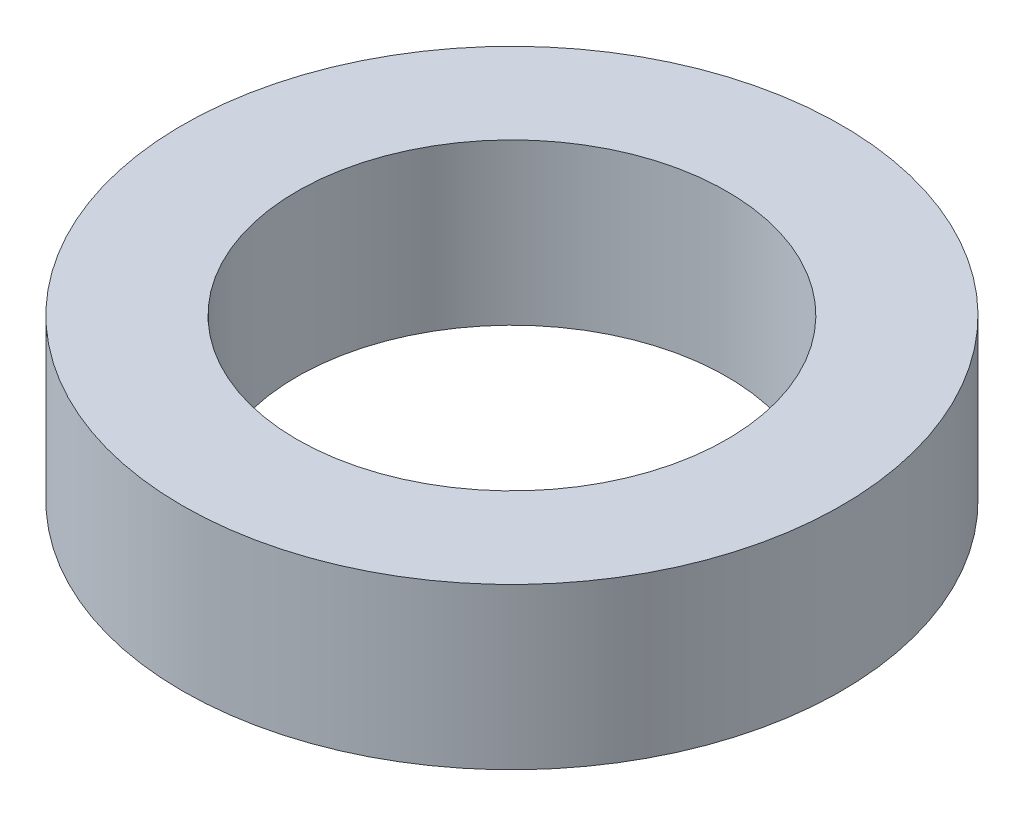
ISO-10303-21;
HEADER;
FILE_DESCRIPTION(('STEP AP214'),'2;1');
FILE_NAME('part.step','',(''),(''),'','','');
FILE_SCHEMA(('AUTOMOTIVE_DESIGN { 1 0 10303 214 1 1 1 1 }'));
ENDSEC;
DATA;
#1=APPLICATION_CONTEXT('core data for automotive mechanical design processes');
#2=APPLICATION_PROTOCOL_DEFINITION('international standard','automotive_design',2000,#1);
#3=PRODUCT_CONTEXT('',#1,'mechanical');
#4=PRODUCT('Part','Part','',(#3));
#5=PRODUCT_RELATED_PRODUCT_CATEGORY('part','',(#4));
#6=PRODUCT_DEFINITION_FORMATION('','',#4);
#7=PRODUCT_DEFINITION_CONTEXT('part definition',#1,'design');
#8=PRODUCT_DEFINITION('design','',#6,#7);
#9=PRODUCT_DEFINITION_SHAPE('','',#8);
#10=(LENGTH_UNIT() NAMED_UNIT(*) SI_UNIT(.MILLI.,.METRE.));
#11=(NAMED_UNIT(*) PLANE_ANGLE_UNIT() SI_UNIT($,.RADIAN.));
#12=(NAMED_UNIT(*) SI_UNIT($,.STERADIAN.) SOLID_ANGLE_UNIT());
#13=UNCERTAINTY_MEASURE_WITH_UNIT(LENGTH_MEASURE(1.E-05),#10,'distance_accuracy_value','');
#14=(GEOMETRIC_REPRESENTATION_CONTEXT(3) GLOBAL_UNCERTAINTY_ASSIGNED_CONTEXT((#13)) GLOBAL_UNIT_ASSIGNED_CONTEXT((#10,
#11,#12)) REPRESENTATION_CONTEXT('',''));
#15=CARTESIAN_POINT('',(0.,0.,0.));
#16=DIRECTION('',(0.,0.,1.));
#17=DIRECTION('',(1.,0.,0.));
#18=AXIS2_PLACEMENT_3D('',#15,#16,#17);
#19=CARTESIAN_POINT('',(0.,28.,0.));
#20=DIRECTION('',(0.,-1.,0.));
#21=DIRECTION('',(0.,0.,-1.));
#22=AXIS2_PLACEMENT_3D('',#19,#20,#21);
#23=CYLINDRICAL_SURFACE('',#22,57.5);
#24=CARTESIAN_POINT('',(0.,28.,0.));
#25=DIRECTION('',(0.,1.,0.));
#26=DIRECTION('',(0.,0.,1.));
#27=AXIS2_PLACEMENT_3D('',#24,#25,#26);
#28=CIRCLE('',#27,57.5);
#29=CARTESIAN_POINT('',(0.,28.,57.5));
#30=VERTEX_POINT('',#29);
#31=EDGE_CURVE('E10',#30,#30,#28,.T.);
#32=ORIENTED_EDGE('',*,*,#31,.F.);
#33=EDGE_LOOP('',(#32));
#34=FACE_BOUND('',#33,.T.);
#35=CARTESIAN_POINT('',(0.,0.,0.));
#36=DIRECTION('',(0.,1.,0.));
#37=DIRECTION('',(0.,0.,1.));
#38=AXIS2_PLACEMENT_3D('',#35,#36,#37);
#39=CIRCLE('',#38,57.5);
#40=CARTESIAN_POINT('',(0.,0.,57.5));
#41=VERTEX_POINT('',#40);
#42=EDGE_CURVE('E37',#41,#41,#39,.T.);
#43=ORIENTED_EDGE('',*,*,#42,.T.);
#44=EDGE_LOOP('',(#43));
#45=FACE_BOUND('',#44,.T.);
#46=ADVANCED_FACE('F40',(#34,#45),#23,.T.);
#47=CARTESIAN_POINT('',(0.,28.,0.));
#48=DIRECTION('',(0.,1.,0.));
#49=DIRECTION('',(0.,0.,1.));
#50=AXIS2_PLACEMENT_3D('',#47,#48,#49);
#51=PLANE('',#50);
#52=CARTESIAN_POINT('',(0.,28.,0.));
#53=DIRECTION('',(0.,1.,0.));
#54=DIRECTION('',(0.,0.,1.));
#55=AXIS2_PLACEMENT_3D('',#52,#53,#54);
#56=CIRCLE('',#55,37.5);
#57=CARTESIAN_POINT('',(0.,28.,37.5));
#58=VERTEX_POINT('',#57);
#59=EDGE_CURVE('E50',#58,#58,#56,.T.);
#60=ORIENTED_EDGE('',*,*,#59,.F.);
#61=EDGE_LOOP('',(#60));
#62=FACE_BOUND('',#61,.T.);
#63=ORIENTED_EDGE('',*,*,#31,.T.);
#64=EDGE_LOOP('',(#63));
#65=FACE_BOUND('',#64,.T.);
#66=ADVANCED_FACE('F59',(#62,#65),#51,.T.);
#67=CARTESIAN_POINT('',(0.,0.,0.));
#68=DIRECTION('',(0.,1.,0.));
#69=DIRECTION('',(0.,0.,1.));
#70=AXIS2_PLACEMENT_3D('',#67,#68,#69);
#71=PLANE('',#70);
#72=CARTESIAN_POINT('',(0.,0.,0.));
#73=DIRECTION('',(0.,1.,0.));
#74=DIRECTION('',(0.,0.,1.));
#75=AXIS2_PLACEMENT_3D('',#72,#73,#74);
#76=CIRCLE('',#75,37.5);
#77=CARTESIAN_POINT('',(0.,0.,37.5));
#78=VERTEX_POINT('',#77);
#79=EDGE_CURVE('E47',#78,#78,#76,.T.);
#80=ORIENTED_EDGE('',*,*,#79,.T.);
#81=EDGE_LOOP('',(#80));
#82=FACE_BOUND('',#81,.T.);
#83=ORIENTED_EDGE('',*,*,#42,.F.);
#84=EDGE_LOOP('',(#83));
#85=FACE_BOUND('',#84,.T.);
#86=ADVANCED_FACE('F58',(#82,#85),#71,.F.);
#87=CARTESIAN_POINT('',(0.,28.,0.));
#88=DIRECTION('',(0.,-1.,0.));
#89=DIRECTION('',(0.,0.,-1.));
#90=AXIS2_PLACEMENT_3D('',#87,#88,#89);
#91=CYLINDRICAL_SURFACE('',#90,37.5);
#92=ORIENTED_EDGE('',*,*,#59,.T.);
#93=EDGE_LOOP('',(#92));
#94=FACE_BOUND('',#93,.T.);
#95=ORIENTED_EDGE('',*,*,#79,.F.);
#96=EDGE_LOOP('',(#95));
#97=FACE_BOUND('',#96,.T.);
#98=ADVANCED_FACE('F54',(#94,#97),#91,.F.);
#99=CLOSED_SHELL('',(#46,#66,#86,#98));
#100=MANIFOLD_SOLID_BREP('B2',#99);
#101=ADVANCED_BREP_SHAPE_REPRESENTATION('',(#18,#100),#14);
#102=SHAPE_DEFINITION_REPRESENTATION(#9,#101);
ENDSEC;
END-ISO-10303-21;
